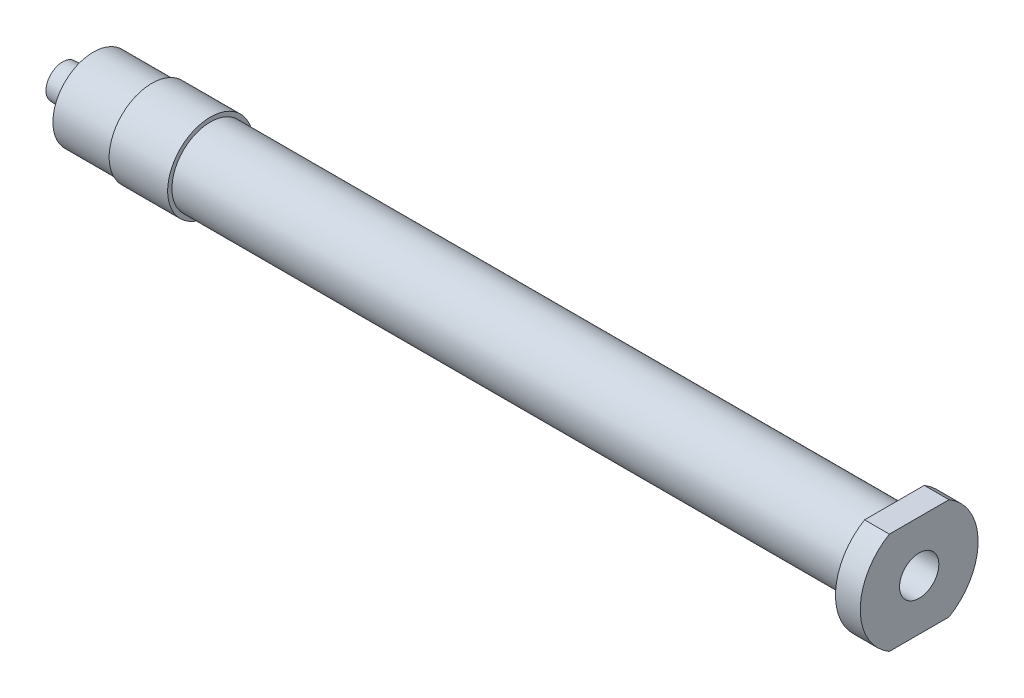
ISO-10303-21;
HEADER;
FILE_DESCRIPTION(('STEP AP214'),'2;1');
FILE_NAME('part.step','',(''),(''),'','','');
FILE_SCHEMA(('AUTOMOTIVE_DESIGN { 1 0 10303 214 1 1 1 1 }'));
ENDSEC;
DATA;
#1=APPLICATION_CONTEXT('core data for automotive mechanical design processes');
#2=APPLICATION_PROTOCOL_DEFINITION('international standard','automotive_design',2000,#1);
#3=PRODUCT_CONTEXT('',#1,'mechanical');
#4=PRODUCT('Part','Part','',(#3));
#5=PRODUCT_RELATED_PRODUCT_CATEGORY('part','',(#4));
#6=PRODUCT_DEFINITION_FORMATION('','',#4);
#7=PRODUCT_DEFINITION_CONTEXT('part definition',#1,'design');
#8=PRODUCT_DEFINITION('design','',#6,#7);
#9=PRODUCT_DEFINITION_SHAPE('','',#8);
#10=(LENGTH_UNIT() NAMED_UNIT(*) SI_UNIT(.MILLI.,.METRE.));
#11=(NAMED_UNIT(*) PLANE_ANGLE_UNIT() SI_UNIT($,.RADIAN.));
#12=(NAMED_UNIT(*) SI_UNIT($,.STERADIAN.) SOLID_ANGLE_UNIT());
#13=UNCERTAINTY_MEASURE_WITH_UNIT(LENGTH_MEASURE(1.E-05),#10,'distance_accuracy_value','');
#14=(GEOMETRIC_REPRESENTATION_CONTEXT(3) GLOBAL_UNCERTAINTY_ASSIGNED_CONTEXT((#13)) GLOBAL_UNIT_ASSIGNED_CONTEXT((#10,
#11,#12)) REPRESENTATION_CONTEXT('',''));
#15=CARTESIAN_POINT('',(0.,0.,0.));
#16=DIRECTION('',(0.,0.,1.));
#17=DIRECTION('',(1.,0.,0.));
#18=AXIS2_PLACEMENT_3D('',#15,#16,#17);
#19=CARTESIAN_POINT('',(50.15,0.,-6.9));
#20=DIRECTION('',(1.,0.,0.));
#21=DIRECTION('',(0.,0.,-1.));
#22=AXIS2_PLACEMENT_3D('',#19,#20,#21);
#23=PLANE('',#22);
#24=CARTESIAN_POINT('',(50.15,0.,0.));
#25=DIRECTION('',(1.,0.,0.));
#26=DIRECTION('',(0.,0.,-1.));
#27=AXIS2_PLACEMENT_3D('',#24,#25,#26);
#28=CIRCLE('',#27,2.3);
#29=CARTESIAN_POINT('',(50.15,0.,-2.3));
#30=VERTEX_POINT('',#29);
#31=EDGE_CURVE('E98',#30,#30,#28,.T.);
#32=ORIENTED_EDGE('',*,*,#31,.F.);
#33=EDGE_LOOP('',(#32));
#34=FACE_BOUND('',#33,.T.);
#35=CARTESIAN_POINT('',(50.15,0.,0.));
#36=DIRECTION('',(1.,0.,0.));
#37=DIRECTION('',(0.,0.,-1.));
#38=AXIS2_PLACEMENT_3D('',#35,#36,#37);
#39=CIRCLE('',#38,6.9);
#40=CARTESIAN_POINT('',(50.15,5.95,3.49392329623877));
#41=VERTEX_POINT('',#40);
#42=CARTESIAN_POINT('',(50.15,-5.95,3.49392329623877));
#43=VERTEX_POINT('',#42);
#44=EDGE_CURVE('E86',#41,#43,#39,.T.);
#45=ORIENTED_EDGE('',*,*,#44,.T.);
#46=DIRECTION('',(0.,0.,-1.));
#47=VECTOR('',#46,1.);
#48=CARTESIAN_POINT('',(50.15,-5.95,7.5));
#49=LINE('',#48,#47);
#50=CARTESIAN_POINT('',(50.15,-5.95,-3.49392329623877));
#51=VERTEX_POINT('',#50);
#52=EDGE_CURVE('E357',#43,#51,#49,.T.);
#53=ORIENTED_EDGE('',*,*,#52,.T.);
#54=CARTESIAN_POINT('',(50.15,5.95,-3.49392329623877));
#55=VERTEX_POINT('',#54);
#56=EDGE_CURVE('E89',#51,#55,#39,.T.);
#57=ORIENTED_EDGE('',*,*,#56,.T.);
#58=DIRECTION('',(0.,0.,1.));
#59=VECTOR('',#58,1.);
#60=CARTESIAN_POINT('',(50.15,5.95,7.5));
#61=LINE('',#60,#59);
#62=EDGE_CURVE('E355',#55,#41,#61,.T.);
#63=ORIENTED_EDGE('',*,*,#62,.T.);
#64=EDGE_LOOP('',(#45,#53,#57,#63));
#65=FACE_BOUND('',#64,.T.);
#66=ADVANCED_FACE('F34',(#34,#65),#23,.T.);
#67=CARTESIAN_POINT('',(50.15,0.,0.));
#68=DIRECTION('',(1.,0.,0.));
#69=DIRECTION('',(0.,0.,-1.));
#70=AXIS2_PLACEMENT_3D('',#67,#68,#69);
#71=CYLINDRICAL_SURFACE('',#70,6.9);
#72=ORIENTED_EDGE('',*,*,#56,.F.);
#73=DIRECTION('',(1.,0.,0.));
#74=VECTOR('',#73,1.);
#75=CARTESIAN_POINT('',(50.15,-5.95,-3.49392329623877));
#76=LINE('',#75,#74);
#77=CARTESIAN_POINT('',(47.25,-5.95,-3.49392329623877));
#78=VERTEX_POINT('',#77);
#79=EDGE_CURVE('E348',#51,#78,#76,.F.);
#80=ORIENTED_EDGE('',*,*,#79,.T.);
#81=CARTESIAN_POINT('',(47.25,0.,0.));
#82=DIRECTION('',(1.,0.,0.));
#83=DIRECTION('',(0.,0.,-1.));
#84=AXIS2_PLACEMENT_3D('',#81,#82,#83);
#85=CIRCLE('',#84,6.9);
#86=CARTESIAN_POINT('',(47.25,5.95,-3.49392329623877));
#87=VERTEX_POINT('',#86);
#88=EDGE_CURVE('E90',#78,#87,#85,.T.);
#89=ORIENTED_EDGE('',*,*,#88,.T.);
#90=DIRECTION('',(1.,0.,0.));
#91=VECTOR('',#90,1.);
#92=CARTESIAN_POINT('',(50.15,5.95,-3.49392329623877));
#93=LINE('',#92,#91);
#94=EDGE_CURVE('E56',#87,#55,#93,.T.);
#95=ORIENTED_EDGE('',*,*,#94,.T.);
#96=EDGE_LOOP('',(#72,#80,#89,#95));
#97=FACE_BOUND('',#96,.T.);
#98=ADVANCED_FACE('F148',(#97),#71,.T.);
#99=CARTESIAN_POINT('',(47.25,5.95,3.49392329623877));
#100=VERTEX_POINT('',#99);
#101=CARTESIAN_POINT('',(47.25,-5.95,3.49392329623877));
#102=VERTEX_POINT('',#101);
#103=EDGE_CURVE('E84',#100,#102,#85,.T.);
#104=ORIENTED_EDGE('',*,*,#103,.T.);
#105=DIRECTION('',(1.,0.,0.));
#106=VECTOR('',#105,1.);
#107=CARTESIAN_POINT('',(50.15,-5.95,3.49392329623877));
#108=LINE('',#107,#106);
#109=EDGE_CURVE('E49',#102,#43,#108,.T.);
#110=ORIENTED_EDGE('',*,*,#109,.T.);
#111=ORIENTED_EDGE('',*,*,#44,.F.);
#112=DIRECTION('',(1.,0.,0.));
#113=VECTOR('',#112,1.);
#114=CARTESIAN_POINT('',(50.15,5.95,3.49392329623877));
#115=LINE('',#114,#113);
#116=EDGE_CURVE('E73',#41,#100,#115,.F.);
#117=ORIENTED_EDGE('',*,*,#116,.T.);
#118=EDGE_LOOP('',(#104,#110,#111,#117));
#119=FACE_BOUND('',#118,.T.);
#120=ADVANCED_FACE('F83',(#119),#71,.T.);
#121=CARTESIAN_POINT('',(47.25,0.,-4.5));
#122=DIRECTION('',(-1.,0.,0.));
#123=DIRECTION('',(0.,0.,1.));
#124=AXIS2_PLACEMENT_3D('',#121,#122,#123);
#125=PLANE('',#124);
#126=CARTESIAN_POINT('',(47.25,0.,0.));
#127=DIRECTION('',(1.,0.,0.));
#128=DIRECTION('',(0.,0.,-1.));
#129=AXIS2_PLACEMENT_3D('',#126,#127,#128);
#130=CIRCLE('',#129,4.5);
#131=CARTESIAN_POINT('',(47.25,0.,-4.5));
#132=VERTEX_POINT('',#131);
#133=EDGE_CURVE('E94',#132,#132,#130,.T.);
#134=ORIENTED_EDGE('',*,*,#133,.T.);
#135=EDGE_LOOP('',(#134));
#136=FACE_BOUND('',#135,.T.);
#137=ORIENTED_EDGE('',*,*,#88,.F.);
#138=DIRECTION('',(0.,0.,1.));
#139=VECTOR('',#138,1.);
#140=CARTESIAN_POINT('',(47.25,-5.95,-4.5));
#141=LINE('',#140,#139);
#142=EDGE_CURVE('E11',#78,#102,#141,.T.);
#143=ORIENTED_EDGE('',*,*,#142,.T.);
#144=ORIENTED_EDGE('',*,*,#103,.F.);
#145=DIRECTION('',(0.,0.,-1.));
#146=VECTOR('',#145,1.);
#147=CARTESIAN_POINT('',(47.25,5.95,-4.5));
#148=LINE('',#147,#146);
#149=EDGE_CURVE('E42',#100,#87,#148,.T.);
#150=ORIENTED_EDGE('',*,*,#149,.T.);
#151=EDGE_LOOP('',(#137,#143,#144,#150));
#152=FACE_BOUND('',#151,.T.);
#153=ADVANCED_FACE('F88',(#136,#152),#125,.T.);
#154=CARTESIAN_POINT('',(-32.85,0.,-5.));
#155=DIRECTION('',(1.,0.,0.));
#156=DIRECTION('',(0.,0.,-1.));
#157=AXIS2_PLACEMENT_3D('',#154,#155,#156);
#158=PLANE('',#157);
#159=CARTESIAN_POINT('',(-32.85,0.,0.));
#160=DIRECTION('',(1.,0.,0.));
#161=DIRECTION('',(0.,0.,-1.));
#162=AXIS2_PLACEMENT_3D('',#159,#160,#161);
#163=CIRCLE('',#162,5.);
#164=CARTESIAN_POINT('',(-32.85,0.,-5.));
#165=VERTEX_POINT('',#164);
#166=EDGE_CURVE('E79',#165,#165,#163,.T.);
#167=ORIENTED_EDGE('',*,*,#166,.T.);
#168=EDGE_LOOP('',(#167));
#169=FACE_BOUND('',#168,.T.);
#170=CARTESIAN_POINT('',(-32.85,0.,0.));
#171=DIRECTION('',(1.,0.,0.));
#172=DIRECTION('',(0.,0.,-1.));
#173=AXIS2_PLACEMENT_3D('',#170,#171,#172);
#174=CIRCLE('',#173,4.5);
#175=CARTESIAN_POINT('',(-32.85,0.,-4.5));
#176=VERTEX_POINT('',#175);
#177=EDGE_CURVE('E346',#176,#176,#174,.T.);
#178=ORIENTED_EDGE('',*,*,#177,.F.);
#179=EDGE_LOOP('',(#178));
#180=FACE_BOUND('',#179,.T.);
#181=ADVANCED_FACE('F36',(#169,#180),#158,.T.);
#182=CARTESIAN_POINT('',(50.15,0.,0.));
#183=DIRECTION('',(1.,0.,0.));
#184=DIRECTION('',(0.,0.,-1.));
#185=AXIS2_PLACEMENT_3D('',#182,#183,#184);
#186=CYLINDRICAL_SURFACE('',#185,4.99999999999999);
#187=CARTESIAN_POINT('',(-39.7,0.,0.));
#188=DIRECTION('',(1.,0.,0.));
#189=DIRECTION('',(0.,0.,-1.));
#190=AXIS2_PLACEMENT_3D('',#187,#188,#189);
#191=CIRCLE('',#190,4.99999999999998);
#192=CARTESIAN_POINT('',(-39.7,0.,-4.99999999999998));
#193=VERTEX_POINT('',#192);
#194=EDGE_CURVE('E128',#193,#193,#191,.T.);
#195=ORIENTED_EDGE('',*,*,#194,.T.);
#196=EDGE_LOOP('',(#195));
#197=FACE_BOUND('',#196,.T.);
#198=ORIENTED_EDGE('',*,*,#166,.F.);
#199=EDGE_LOOP('',(#198));
#200=FACE_BOUND('',#199,.T.);
#201=ADVANCED_FACE('F136',(#197,#200),#186,.T.);
#202=CARTESIAN_POINT('',(-39.7,0.,-4.73999999999998));
#203=DIRECTION('',(-1.,0.,0.));
#204=DIRECTION('',(0.,0.,1.));
#205=AXIS2_PLACEMENT_3D('',#202,#203,#204);
#206=PLANE('',#205);
#207=CARTESIAN_POINT('',(-39.7,0.,0.));
#208=DIRECTION('',(1.,0.,0.));
#209=DIRECTION('',(0.,0.,-1.));
#210=AXIS2_PLACEMENT_3D('',#207,#208,#209);
#211=CIRCLE('',#210,4.73999999999998);
#212=CARTESIAN_POINT('',(-39.7,0.,-4.73999999999998));
#213=VERTEX_POINT('',#212);
#214=EDGE_CURVE('E125',#213,#213,#211,.T.);
#215=ORIENTED_EDGE('',*,*,#214,.T.);
#216=EDGE_LOOP('',(#215));
#217=FACE_BOUND('',#216,.T.);
#218=ORIENTED_EDGE('',*,*,#194,.F.);
#219=EDGE_LOOP('',(#218));
#220=FACE_BOUND('',#219,.T.);
#221=ADVANCED_FACE('F138',(#217,#220),#206,.T.);
#222=CARTESIAN_POINT('',(50.15,0.,0.));
#223=DIRECTION('',(1.,0.,0.));
#224=DIRECTION('',(0.,0.,-1.));
#225=AXIS2_PLACEMENT_3D('',#222,#223,#224);
#226=CYLINDRICAL_SURFACE('',#225,4.73999999999998);
#227=CARTESIAN_POINT('',(-46.55,0.,0.));
#228=DIRECTION('',(1.,0.,0.));
#229=DIRECTION('',(0.,0.,-1.));
#230=AXIS2_PLACEMENT_3D('',#227,#228,#229);
#231=CIRCLE('',#230,4.73999999999998);
#232=CARTESIAN_POINT('',(-46.55,0.,-4.73999999999998));
#233=VERTEX_POINT('',#232);
#234=EDGE_CURVE('E122',#233,#233,#231,.T.);
#235=ORIENTED_EDGE('',*,*,#234,.T.);
#236=EDGE_LOOP('',(#235));
#237=FACE_BOUND('',#236,.T.);
#238=ORIENTED_EDGE('',*,*,#214,.F.);
#239=EDGE_LOOP('',(#238));
#240=FACE_BOUND('',#239,.T.);
#241=ADVANCED_FACE('F144',(#237,#240),#226,.T.);
#242=CARTESIAN_POINT('',(-46.55,0.,-4.09999999999998));
#243=DIRECTION('',(-1.,0.,0.));
#244=DIRECTION('',(0.,0.,1.));
#245=AXIS2_PLACEMENT_3D('',#242,#243,#244);
#246=PLANE('',#245);
#247=CARTESIAN_POINT('',(-46.55,0.,0.));
#248=DIRECTION('',(1.,0.,0.));
#249=DIRECTION('',(0.,0.,-1.));
#250=AXIS2_PLACEMENT_3D('',#247,#248,#249);
#251=CIRCLE('',#250,4.09999999999998);
#252=CARTESIAN_POINT('',(-46.55,0.,-4.09999999999998));
#253=VERTEX_POINT('',#252);
#254=EDGE_CURVE('E119',#253,#253,#251,.T.);
#255=ORIENTED_EDGE('',*,*,#254,.T.);
#256=EDGE_LOOP('',(#255));
#257=FACE_BOUND('',#256,.T.);
#258=ORIENTED_EDGE('',*,*,#234,.F.);
#259=EDGE_LOOP('',(#258));
#260=FACE_BOUND('',#259,.T.);
#261=ADVANCED_FACE('F188',(#257,#260),#246,.T.);
#262=CARTESIAN_POINT('',(50.15,0.,0.));
#263=DIRECTION('',(1.,0.,0.));
#264=DIRECTION('',(0.,0.,-1.));
#265=AXIS2_PLACEMENT_3D('',#262,#263,#264);
#266=CYLINDRICAL_SURFACE('',#265,4.09999999999998);
#267=CARTESIAN_POINT('',(-43.05,0.,0.));
#268=DIRECTION('',(1.,0.,0.));
#269=DIRECTION('',(0.,0.,-1.));
#270=AXIS2_PLACEMENT_3D('',#267,#268,#269);
#271=CIRCLE('',#270,4.09999999999998);
#272=CARTESIAN_POINT('',(-43.05,0.,-4.09999999999998));
#273=VERTEX_POINT('',#272);
#274=EDGE_CURVE('E116',#273,#273,#271,.T.);
#275=ORIENTED_EDGE('',*,*,#274,.T.);
#276=EDGE_LOOP('',(#275));
#277=FACE_BOUND('',#276,.T.);
#278=ORIENTED_EDGE('',*,*,#254,.F.);
#279=EDGE_LOOP('',(#278));
#280=FACE_BOUND('',#279,.T.);
#281=ADVANCED_FACE('F184',(#277,#280),#266,.F.);
#282=CARTESIAN_POINT('',(-43.05,0.,-2.32209523290953));
#283=DIRECTION('',(-1.,0.,0.));
#284=DIRECTION('',(0.,0.,1.));
#285=AXIS2_PLACEMENT_3D('',#282,#283,#284);
#286=PLANE('',#285);
#287=CARTESIAN_POINT('',(-43.05,0.,0.));
#288=DIRECTION('',(1.,0.,0.));
#289=DIRECTION('',(0.,0.,-1.));
#290=AXIS2_PLACEMENT_3D('',#287,#288,#289);
#291=CIRCLE('',#290,2.32209523290953);
#292=CARTESIAN_POINT('',(-43.05,0.,-2.32209523290953));
#293=VERTEX_POINT('',#292);
#294=EDGE_CURVE('E113',#293,#293,#291,.T.);
#295=ORIENTED_EDGE('',*,*,#294,.T.);
#296=EDGE_LOOP('',(#295));
#297=FACE_BOUND('',#296,.T.);
#298=ORIENTED_EDGE('',*,*,#274,.F.);
#299=EDGE_LOOP('',(#298));
#300=FACE_BOUND('',#299,.T.);
#301=ADVANCED_FACE('F180',(#297,#300),#286,.T.);
#302=CARTESIAN_POINT('',(-43.05,0.,0.));
#303=DIRECTION('',(1.,0.,0.));
#304=DIRECTION('',(0.,0.,-1.));
#305=AXIS2_PLACEMENT_3D('',#302,#303,#304);
#306=CONICAL_SURFACE('',#305,2.32209523290953,0.0523598775598232);
#307=CARTESIAN_POINT('',(-50.15,0.,0.));
#308=DIRECTION('',(1.,0.,0.));
#309=DIRECTION('',(0.,0.,-1.));
#310=AXIS2_PLACEMENT_3D('',#307,#308,#309);
#311=CIRCLE('',#310,1.94999999999999);
#312=CARTESIAN_POINT('',(-50.15,0.,-1.94999999999999));
#313=VERTEX_POINT('',#312);
#314=EDGE_CURVE('E110',#313,#313,#311,.T.);
#315=ORIENTED_EDGE('',*,*,#314,.T.);
#316=EDGE_LOOP('',(#315));
#317=FACE_BOUND('',#316,.T.);
#318=ORIENTED_EDGE('',*,*,#294,.F.);
#319=EDGE_LOOP('',(#318));
#320=FACE_BOUND('',#319,.T.);
#321=ADVANCED_FACE('F176',(#317,#320),#306,.T.);
#322=CARTESIAN_POINT('',(-50.15,0.,-0.749999999999988));
#323=DIRECTION('',(-1.,0.,0.));
#324=DIRECTION('',(0.,0.,1.));
#325=AXIS2_PLACEMENT_3D('',#322,#323,#324);
#326=PLANE('',#325);
#327=CARTESIAN_POINT('',(-50.15,0.,0.));
#328=DIRECTION('',(1.,0.,0.));
#329=DIRECTION('',(0.,0.,-1.));
#330=AXIS2_PLACEMENT_3D('',#327,#328,#329);
#331=CIRCLE('',#330,0.749999999999989);
#332=CARTESIAN_POINT('',(-50.15,0.,-0.749999999999988));
#333=VERTEX_POINT('',#332);
#334=EDGE_CURVE('E107',#333,#333,#331,.T.);
#335=ORIENTED_EDGE('',*,*,#334,.T.);
#336=EDGE_LOOP('',(#335));
#337=FACE_BOUND('',#336,.T.);
#338=ORIENTED_EDGE('',*,*,#314,.F.);
#339=EDGE_LOOP('',(#338));
#340=FACE_BOUND('',#339,.T.);
#341=ADVANCED_FACE('F172',(#337,#340),#326,.T.);
#342=CARTESIAN_POINT('',(50.15,0.,0.));
#343=DIRECTION('',(1.,0.,0.));
#344=DIRECTION('',(0.,0.,-1.));
#345=AXIS2_PLACEMENT_3D('',#342,#343,#344);
#346=CYLINDRICAL_SURFACE('',#345,0.749999999999988);
#347=CARTESIAN_POINT('',(-32.85,0.,0.));
#348=DIRECTION('',(1.,0.,0.));
#349=DIRECTION('',(0.,0.,-1.));
#350=AXIS2_PLACEMENT_3D('',#347,#348,#349);
#351=CIRCLE('',#350,0.749999999999988);
#352=CARTESIAN_POINT('',(-32.85,0.,-0.749999999999988));
#353=VERTEX_POINT('',#352);
#354=EDGE_CURVE('E104',#353,#353,#351,.T.);
#355=ORIENTED_EDGE('',*,*,#354,.T.);
#356=EDGE_LOOP('',(#355));
#357=FACE_BOUND('',#356,.T.);
#358=ORIENTED_EDGE('',*,*,#334,.F.);
#359=EDGE_LOOP('',(#358));
#360=FACE_BOUND('',#359,.T.);
#361=ADVANCED_FACE('F168',(#357,#360),#346,.F.);
#362=CARTESIAN_POINT('',(-32.85,0.,-0.749999999999988));
#363=DIRECTION('',(1.,0.,0.));
#364=DIRECTION('',(0.,0.,-1.));
#365=AXIS2_PLACEMENT_3D('',#362,#363,#364);
#366=PLANE('',#365);
#367=CARTESIAN_POINT('',(-32.85,0.,0.));
#368=DIRECTION('',(1.,0.,0.));
#369=DIRECTION('',(0.,0.,-1.));
#370=AXIS2_PLACEMENT_3D('',#367,#368,#369);
#371=CIRCLE('',#370,2.3);
#372=CARTESIAN_POINT('',(-32.85,0.,-2.3));
#373=VERTEX_POINT('',#372);
#374=EDGE_CURVE('E101',#373,#373,#371,.T.);
#375=ORIENTED_EDGE('',*,*,#374,.T.);
#376=EDGE_LOOP('',(#375));
#377=FACE_BOUND('',#376,.T.);
#378=ORIENTED_EDGE('',*,*,#354,.F.);
#379=EDGE_LOOP('',(#378));
#380=FACE_BOUND('',#379,.T.);
#381=ADVANCED_FACE('F164',(#377,#380),#366,.T.);
#382=CARTESIAN_POINT('',(50.15,0.,0.));
#383=DIRECTION('',(1.,0.,0.));
#384=DIRECTION('',(0.,0.,-1.));
#385=AXIS2_PLACEMENT_3D('',#382,#383,#384);
#386=CYLINDRICAL_SURFACE('',#385,2.3);
#387=ORIENTED_EDGE('',*,*,#31,.T.);
#388=EDGE_LOOP('',(#387));
#389=FACE_BOUND('',#388,.T.);
#390=ORIENTED_EDGE('',*,*,#374,.F.);
#391=EDGE_LOOP('',(#390));
#392=FACE_BOUND('',#391,.T.);
#393=ADVANCED_FACE('F160',(#389,#392),#386,.F.);
#394=CARTESIAN_POINT('',(50.15,0.,0.));
#395=DIRECTION('',(1.,0.,0.));
#396=DIRECTION('',(0.,0.,-1.));
#397=AXIS2_PLACEMENT_3D('',#394,#395,#396);
#398=CYLINDRICAL_SURFACE('',#397,4.5);
#399=ORIENTED_EDGE('',*,*,#177,.T.);
#400=EDGE_LOOP('',(#399));
#401=FACE_BOUND('',#400,.T.);
#402=ORIENTED_EDGE('',*,*,#133,.F.);
#403=EDGE_LOOP('',(#402));
#404=FACE_BOUND('',#403,.T.);
#405=ADVANCED_FACE('F163',(#401,#404),#398,.T.);
#406=CARTESIAN_POINT('',(22.474810797897,5.95,7.5));
#407=DIRECTION('',(0.,1.,0.));
#408=DIRECTION('',(0.,0.,1.));
#409=AXIS2_PLACEMENT_3D('',#406,#407,#408);
#410=PLANE('',#409);
#411=ORIENTED_EDGE('',*,*,#62,.F.);
#412=ORIENTED_EDGE('',*,*,#94,.F.);
#413=ORIENTED_EDGE('',*,*,#149,.F.);
#414=ORIENTED_EDGE('',*,*,#116,.F.);
#415=EDGE_LOOP('',(#411,#412,#413,#414));
#416=FACE_BOUND('',#415,.T.);
#417=ADVANCED_FACE('F72',(#416),#410,.T.);
#418=CARTESIAN_POINT('',(22.474810797897,-5.95,7.5));
#419=DIRECTION('',(0.,-1.,0.));
#420=DIRECTION('',(0.,0.,-1.));
#421=AXIS2_PLACEMENT_3D('',#418,#419,#420);
#422=PLANE('',#421);
#423=ORIENTED_EDGE('',*,*,#52,.F.);
#424=ORIENTED_EDGE('',*,*,#109,.F.);
#425=ORIENTED_EDGE('',*,*,#142,.F.);
#426=ORIENTED_EDGE('',*,*,#79,.F.);
#427=EDGE_LOOP('',(#423,#424,#425,#426));
#428=FACE_BOUND('',#427,.T.);
#429=ADVANCED_FACE('F250',(#428),#422,.T.);
#430=CLOSED_SHELL('',(#66,#98,#120,#153,#181,#201,#221,#241,#261,#281,#301,#321,#341,#361,#381,
#393,#405,#417,#429));
#431=MANIFOLD_SOLID_BREP('B2',#430);
#432=ADVANCED_BREP_SHAPE_REPRESENTATION('',(#18,#431),#14);
#433=SHAPE_DEFINITION_REPRESENTATION(#9,#432);
ENDSEC;
END-ISO-10303-21;
